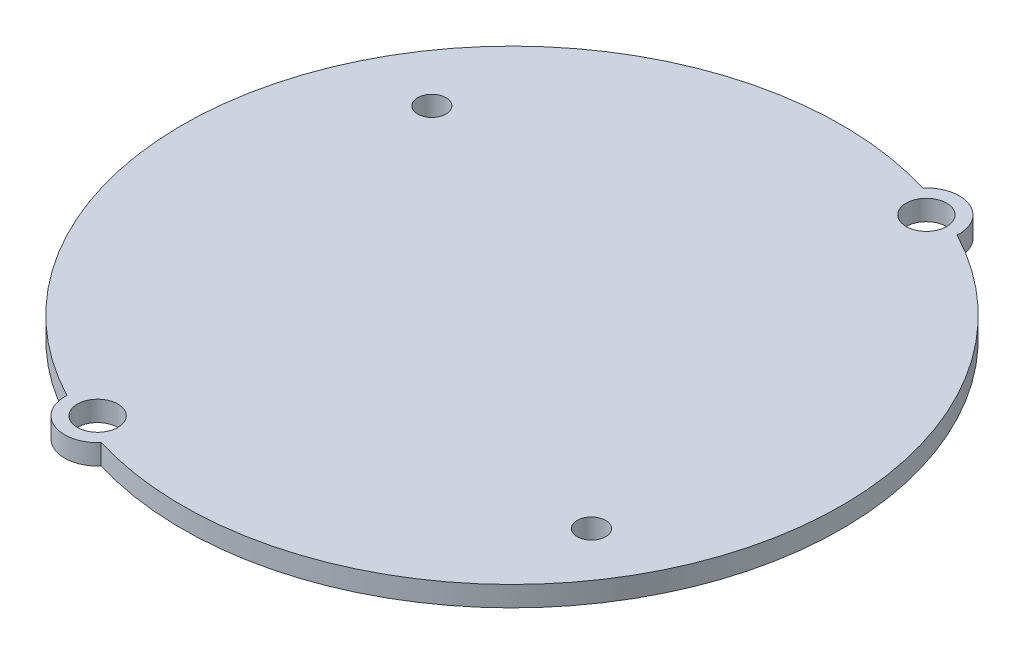
ISO-10303-21;
HEADER;
FILE_DESCRIPTION(('STEP AP214'),'2;1');
FILE_NAME('part.step','',(''),(''),'','','');
FILE_SCHEMA(('AUTOMOTIVE_DESIGN { 1 0 10303 214 1 1 1 1 }'));
ENDSEC;
DATA;
#1=APPLICATION_CONTEXT('core data for automotive mechanical design processes');
#2=APPLICATION_PROTOCOL_DEFINITION('international standard','automotive_design',2000,#1);
#3=PRODUCT_CONTEXT('',#1,'mechanical');
#4=PRODUCT('Part','Part','',(#3));
#5=PRODUCT_RELATED_PRODUCT_CATEGORY('part','',(#4));
#6=PRODUCT_DEFINITION_FORMATION('','',#4);
#7=PRODUCT_DEFINITION_CONTEXT('part definition',#1,'design');
#8=PRODUCT_DEFINITION('design','',#6,#7);
#9=PRODUCT_DEFINITION_SHAPE('','',#8);
#10=(LENGTH_UNIT() NAMED_UNIT(*) SI_UNIT(.MILLI.,.METRE.));
#11=(NAMED_UNIT(*) PLANE_ANGLE_UNIT() SI_UNIT($,.RADIAN.));
#12=(NAMED_UNIT(*) SI_UNIT($,.STERADIAN.) SOLID_ANGLE_UNIT());
#13=UNCERTAINTY_MEASURE_WITH_UNIT(LENGTH_MEASURE(1.E-05),#10,'distance_accuracy_value','');
#14=(GEOMETRIC_REPRESENTATION_CONTEXT(3) GLOBAL_UNCERTAINTY_ASSIGNED_CONTEXT((#13)) GLOBAL_UNIT_ASSIGNED_CONTEXT((#10,
#11,#12)) REPRESENTATION_CONTEXT('',''));
#15=CARTESIAN_POINT('',(0.,0.,0.));
#16=DIRECTION('',(0.,0.,1.));
#17=DIRECTION('',(1.,0.,0.));
#18=AXIS2_PLACEMENT_3D('',#15,#16,#17);
#19=CARTESIAN_POINT('',(5.92494005085191,2.,-14.5));
#20=DIRECTION('',(0.,1.,0.));
#21=DIRECTION('',(0.,0.,1.));
#22=AXIS2_PLACEMENT_3D('',#19,#20,#21);
#23=PLANE('',#22);
#24=CARTESIAN_POINT('',(-21.83,2.,-13.9266116253345));
#25=DIRECTION('',(0.,1.,0.));
#26=DIRECTION('',(0.,0.,1.));
#27=AXIS2_PLACEMENT_3D('',#24,#25,#26);
#28=CIRCLE('',#27,1.40000000000001);
#29=CARTESIAN_POINT('',(-21.83,2.,-12.5266116253345));
#30=VERTEX_POINT('',#29);
#31=EDGE_CURVE('E120',#30,#30,#28,.F.);
#32=ORIENTED_EDGE('',*,*,#31,.T.);
#33=EDGE_LOOP('',(#32));
#34=FACE_BOUND('',#33,.T.);
#35=CARTESIAN_POINT('',(22.12,2.,14.29));
#36=DIRECTION('',(0.,1.,0.));
#37=DIRECTION('',(0.,0.,1.));
#38=AXIS2_PLACEMENT_3D('',#35,#36,#37);
#39=CIRCLE('',#38,1.4);
#40=CARTESIAN_POINT('',(22.12,2.,15.69));
#41=VERTEX_POINT('',#40);
#42=EDGE_CURVE('E125',#41,#41,#39,.F.);
#43=ORIENTED_EDGE('',*,*,#42,.T.);
#44=EDGE_LOOP('',(#43));
#45=FACE_BOUND('',#44,.T.);
#46=CARTESIAN_POINT('',(11.8498801017038,2.,-29.));
#47=DIRECTION('',(0.,1.,0.));
#48=DIRECTION('',(0.,0.,1.));
#49=AXIS2_PLACEMENT_3D('',#46,#47,#48);
#50=CIRCLE('',#49,2.);
#51=CARTESIAN_POINT('',(11.8498801017038,2.,-27.));
#52=VERTEX_POINT('',#51);
#53=EDGE_CURVE('E99',#52,#52,#50,.T.);
#54=ORIENTED_EDGE('',*,*,#53,.F.);
#55=EDGE_LOOP('',(#54));
#56=FACE_BOUND('',#55,.T.);
#57=CARTESIAN_POINT('',(0.,2.,0.));
#58=DIRECTION('',(0.,1.,0.));
#59=DIRECTION('',(0.,0.,1.));
#60=AXIS2_PLACEMENT_3D('',#57,#58,#59);
#61=CIRCLE('',#60,32.5);
#62=CARTESIAN_POINT('',(-9.3831152355607,2.,31.1160271962246));
#63=VERTEX_POINT('',#62);
#64=CARTESIAN_POINT('',(15.0926292376997,2.,-28.7830252526264));
#65=VERTEX_POINT('',#64);
#66=EDGE_CURVE('E84',#63,#65,#61,.T.);
#67=ORIENTED_EDGE('',*,*,#66,.T.);
#68=CARTESIAN_POINT('',(11.8498801017038,2.,-29.));
#69=DIRECTION('',(0.,1.,0.));
#70=DIRECTION('',(0.,0.,1.));
#71=AXIS2_PLACEMENT_3D('',#68,#69,#70);
#72=CIRCLE('',#71,3.25);
#73=CARTESIAN_POINT('',(9.38311523556074,2.,-31.1160271962246));
#74=VERTEX_POINT('',#73);
#75=EDGE_CURVE('E79',#65,#74,#72,.T.);
#76=ORIENTED_EDGE('',*,*,#75,.T.);
#77=CARTESIAN_POINT('',(0.,2.,0.));
#78=DIRECTION('',(0.,1.,0.));
#79=DIRECTION('',(0.,0.,1.));
#80=AXIS2_PLACEMENT_3D('',#77,#78,#79);
#81=CIRCLE('',#80,32.5);
#82=CARTESIAN_POINT('',(-15.0926292376997,2.,28.7830252526264));
#83=VERTEX_POINT('',#82);
#84=EDGE_CURVE('E82',#74,#83,#81,.T.);
#85=ORIENTED_EDGE('',*,*,#84,.T.);
#86=CARTESIAN_POINT('',(-11.8498801017038,2.,29.));
#87=DIRECTION('',(0.,1.,0.));
#88=DIRECTION('',(0.,0.,1.));
#89=AXIS2_PLACEMENT_3D('',#86,#87,#88);
#90=CIRCLE('',#89,3.25000000000003);
#91=EDGE_CURVE('E49',#83,#63,#90,.T.);
#92=ORIENTED_EDGE('',*,*,#91,.T.);
#93=EDGE_LOOP('',(#67,#76,#85,#92));
#94=FACE_BOUND('',#93,.T.);
#95=CARTESIAN_POINT('',(-11.8498801017038,2.,29.));
#96=DIRECTION('',(0.,1.,0.));
#97=DIRECTION('',(0.,0.,1.));
#98=AXIS2_PLACEMENT_3D('',#95,#96,#97);
#99=CIRCLE('',#98,2.);
#100=CARTESIAN_POINT('',(-11.8498801017038,2.,31.));
#101=VERTEX_POINT('',#100);
#102=EDGE_CURVE('E114',#101,#101,#99,.T.);
#103=ORIENTED_EDGE('',*,*,#102,.F.);
#104=EDGE_LOOP('',(#103));
#105=FACE_BOUND('',#104,.T.);
#106=ADVANCED_FACE('F32',(#34,#45,#56,#94,#105),#23,.T.);
#107=CARTESIAN_POINT('',(5.92494005085191,0.,-14.5));
#108=DIRECTION('',(0.,1.,0.));
#109=DIRECTION('',(0.,0.,1.));
#110=AXIS2_PLACEMENT_3D('',#107,#108,#109);
#111=PLANE('',#110);
#112=CARTESIAN_POINT('',(-21.83,0.,-13.9266116253345));
#113=DIRECTION('',(0.,-1.,0.));
#114=DIRECTION('',(0.,0.,-1.));
#115=AXIS2_PLACEMENT_3D('',#112,#113,#114);
#116=CIRCLE('',#115,1.40000000000001);
#117=CARTESIAN_POINT('',(-21.83,0.,-15.3266116253345));
#118=VERTEX_POINT('',#117);
#119=EDGE_CURVE('E128',#118,#118,#116,.F.);
#120=ORIENTED_EDGE('',*,*,#119,.T.);
#121=EDGE_LOOP('',(#120));
#122=FACE_BOUND('',#121,.T.);
#123=CARTESIAN_POINT('',(22.12,0.,14.29));
#124=DIRECTION('',(0.,-1.,0.));
#125=DIRECTION('',(0.,0.,-1.));
#126=AXIS2_PLACEMENT_3D('',#123,#124,#125);
#127=CIRCLE('',#126,1.4);
#128=CARTESIAN_POINT('',(22.12,0.,12.89));
#129=VERTEX_POINT('',#128);
#130=EDGE_CURVE('E129',#129,#129,#127,.F.);
#131=ORIENTED_EDGE('',*,*,#130,.T.);
#132=EDGE_LOOP('',(#131));
#133=FACE_BOUND('',#132,.T.);
#134=CARTESIAN_POINT('',(0.,0.,0.));
#135=DIRECTION('',(0.,1.,0.));
#136=DIRECTION('',(0.,0.,1.));
#137=AXIS2_PLACEMENT_3D('',#134,#135,#136);
#138=CIRCLE('',#137,32.5);
#139=CARTESIAN_POINT('',(-9.3831152355607,0.,31.1160271962246));
#140=VERTEX_POINT('',#139);
#141=CARTESIAN_POINT('',(15.0926292376997,0.,-28.7830252526264));
#142=VERTEX_POINT('',#141);
#143=EDGE_CURVE('E96',#140,#142,#138,.T.);
#144=ORIENTED_EDGE('',*,*,#143,.F.);
#145=CARTESIAN_POINT('',(-11.8498801017038,0.,29.));
#146=DIRECTION('',(0.,1.,0.));
#147=DIRECTION('',(0.,0.,1.));
#148=AXIS2_PLACEMENT_3D('',#145,#146,#147);
#149=CIRCLE('',#148,3.25000000000003);
#150=CARTESIAN_POINT('',(-15.0926292376997,0.,28.7830252526264));
#151=VERTEX_POINT('',#150);
#152=EDGE_CURVE('E72',#151,#140,#149,.T.);
#153=ORIENTED_EDGE('',*,*,#152,.F.);
#154=CARTESIAN_POINT('',(0.,0.,0.));
#155=DIRECTION('',(0.,1.,0.));
#156=DIRECTION('',(0.,0.,1.));
#157=AXIS2_PLACEMENT_3D('',#154,#155,#156);
#158=CIRCLE('',#157,32.5);
#159=CARTESIAN_POINT('',(9.38311523556074,0.,-31.1160271962246));
#160=VERTEX_POINT('',#159);
#161=EDGE_CURVE('E66',#160,#151,#158,.T.);
#162=ORIENTED_EDGE('',*,*,#161,.F.);
#163=CARTESIAN_POINT('',(11.8498801017038,0.,-29.));
#164=DIRECTION('',(0.,1.,0.));
#165=DIRECTION('',(0.,0.,1.));
#166=AXIS2_PLACEMENT_3D('',#163,#164,#165);
#167=CIRCLE('',#166,3.25);
#168=EDGE_CURVE('E88',#142,#160,#167,.T.);
#169=ORIENTED_EDGE('',*,*,#168,.F.);
#170=EDGE_LOOP('',(#144,#153,#162,#169));
#171=FACE_BOUND('',#170,.T.);
#172=CARTESIAN_POINT('',(11.8498801017038,0.,-29.));
#173=DIRECTION('',(0.,1.,0.));
#174=DIRECTION('',(0.,0.,1.));
#175=AXIS2_PLACEMENT_3D('',#172,#173,#174);
#176=CIRCLE('',#175,2.);
#177=CARTESIAN_POINT('',(11.8498801017038,0.,-27.));
#178=VERTEX_POINT('',#177);
#179=EDGE_CURVE('E111',#178,#178,#176,.T.);
#180=ORIENTED_EDGE('',*,*,#179,.T.);
#181=EDGE_LOOP('',(#180));
#182=FACE_BOUND('',#181,.T.);
#183=CARTESIAN_POINT('',(-11.8498801017038,0.,29.));
#184=DIRECTION('',(0.,1.,0.));
#185=DIRECTION('',(0.,0.,1.));
#186=AXIS2_PLACEMENT_3D('',#183,#184,#185);
#187=CIRCLE('',#186,2.);
#188=CARTESIAN_POINT('',(-11.8498801017038,0.,31.));
#189=VERTEX_POINT('',#188);
#190=EDGE_CURVE('E117',#189,#189,#187,.T.);
#191=ORIENTED_EDGE('',*,*,#190,.T.);
#192=EDGE_LOOP('',(#191));
#193=FACE_BOUND('',#192,.T.);
#194=ADVANCED_FACE('F107',(#122,#133,#171,#182,#193),#111,.F.);
#195=CARTESIAN_POINT('',(0.,2.,0.));
#196=DIRECTION('',(0.,-1.,0.));
#197=DIRECTION('',(0.,0.,-1.));
#198=AXIS2_PLACEMENT_3D('',#195,#196,#197);
#199=CYLINDRICAL_SURFACE('',#198,32.5);
#200=ORIENTED_EDGE('',*,*,#143,.T.);
#201=DIRECTION('',(0.,-1.,0.));
#202=VECTOR('',#201,1.);
#203=CARTESIAN_POINT('',(15.0926292376997,2.,-28.7830252526264));
#204=LINE('',#203,#202);
#205=EDGE_CURVE('E11',#65,#142,#204,.T.);
#206=ORIENTED_EDGE('',*,*,#205,.F.);
#207=ORIENTED_EDGE('',*,*,#66,.F.);
#208=DIRECTION('',(0.,-1.,0.));
#209=VECTOR('',#208,1.);
#210=CARTESIAN_POINT('',(-9.3831152355607,2.,31.1160271962246));
#211=LINE('',#210,#209);
#212=EDGE_CURVE('E92',#63,#140,#211,.T.);
#213=ORIENTED_EDGE('',*,*,#212,.T.);
#214=EDGE_LOOP('',(#200,#206,#207,#213));
#215=FACE_BOUND('',#214,.T.);
#216=ADVANCED_FACE('F34',(#215),#199,.T.);
#217=CARTESIAN_POINT('',(11.8498801017038,2.,-29.));
#218=DIRECTION('',(0.,-1.,0.));
#219=DIRECTION('',(0.,0.,-1.));
#220=AXIS2_PLACEMENT_3D('',#217,#218,#219);
#221=CYLINDRICAL_SURFACE('',#220,3.25);
#222=ORIENTED_EDGE('',*,*,#168,.T.);
#223=DIRECTION('',(0.,-1.,0.));
#224=VECTOR('',#223,1.);
#225=CARTESIAN_POINT('',(9.38311523556074,2.,-31.1160271962246));
#226=LINE('',#225,#224);
#227=EDGE_CURVE('E41',#74,#160,#226,.T.);
#228=ORIENTED_EDGE('',*,*,#227,.F.);
#229=ORIENTED_EDGE('',*,*,#75,.F.);
#230=ORIENTED_EDGE('',*,*,#205,.T.);
#231=EDGE_LOOP('',(#222,#228,#229,#230));
#232=FACE_BOUND('',#231,.T.);
#233=ADVANCED_FACE('F87',(#232),#221,.T.);
#234=CARTESIAN_POINT('',(0.,2.,0.));
#235=DIRECTION('',(0.,-1.,0.));
#236=DIRECTION('',(0.,0.,-1.));
#237=AXIS2_PLACEMENT_3D('',#234,#235,#236);
#238=CYLINDRICAL_SURFACE('',#237,32.5);
#239=ORIENTED_EDGE('',*,*,#161,.T.);
#240=DIRECTION('',(0.,-1.,0.));
#241=VECTOR('',#240,1.);
#242=CARTESIAN_POINT('',(-15.0926292376997,2.,28.7830252526264));
#243=LINE('',#242,#241);
#244=EDGE_CURVE('E89',#83,#151,#243,.T.);
#245=ORIENTED_EDGE('',*,*,#244,.F.);
#246=ORIENTED_EDGE('',*,*,#84,.F.);
#247=ORIENTED_EDGE('',*,*,#227,.T.);
#248=EDGE_LOOP('',(#239,#245,#246,#247));
#249=FACE_BOUND('',#248,.T.);
#250=ADVANCED_FACE('F90',(#249),#238,.T.);
#251=CARTESIAN_POINT('',(-11.8498801017038,2.,29.));
#252=DIRECTION('',(0.,-1.,0.));
#253=DIRECTION('',(0.,0.,-1.));
#254=AXIS2_PLACEMENT_3D('',#251,#252,#253);
#255=CYLINDRICAL_SURFACE('',#254,3.25000000000003);
#256=ORIENTED_EDGE('',*,*,#152,.T.);
#257=ORIENTED_EDGE('',*,*,#212,.F.);
#258=ORIENTED_EDGE('',*,*,#91,.F.);
#259=ORIENTED_EDGE('',*,*,#244,.T.);
#260=EDGE_LOOP('',(#256,#257,#258,#259));
#261=FACE_BOUND('',#260,.T.);
#262=ADVANCED_FACE('F104',(#261),#255,.T.);
#263=CARTESIAN_POINT('',(11.8498801017038,2.,-29.));
#264=DIRECTION('',(0.,-1.,0.));
#265=DIRECTION('',(0.,0.,-1.));
#266=AXIS2_PLACEMENT_3D('',#263,#264,#265);
#267=CYLINDRICAL_SURFACE('',#266,2.);
#268=ORIENTED_EDGE('',*,*,#53,.T.);
#269=EDGE_LOOP('',(#268));
#270=FACE_BOUND('',#269,.T.);
#271=ORIENTED_EDGE('',*,*,#179,.F.);
#272=EDGE_LOOP('',(#271));
#273=FACE_BOUND('',#272,.T.);
#274=ADVANCED_FACE('F158',(#270,#273),#267,.F.);
#275=CARTESIAN_POINT('',(-11.8498801017038,2.,29.));
#276=DIRECTION('',(0.,-1.,0.));
#277=DIRECTION('',(0.,0.,-1.));
#278=AXIS2_PLACEMENT_3D('',#275,#276,#277);
#279=CYLINDRICAL_SURFACE('',#278,2.);
#280=ORIENTED_EDGE('',*,*,#102,.T.);
#281=EDGE_LOOP('',(#280));
#282=FACE_BOUND('',#281,.T.);
#283=ORIENTED_EDGE('',*,*,#190,.F.);
#284=EDGE_LOOP('',(#283));
#285=FACE_BOUND('',#284,.T.);
#286=ADVANCED_FACE('F145',(#282,#285),#279,.F.);
#287=CARTESIAN_POINT('',(22.12,10.,14.29));
#288=DIRECTION('',(0.,-1.,0.));
#289=DIRECTION('',(0.,0.,-1.));
#290=AXIS2_PLACEMENT_3D('',#287,#288,#289);
#291=CYLINDRICAL_SURFACE('',#290,1.4);
#292=ORIENTED_EDGE('',*,*,#42,.F.);
#293=EDGE_LOOP('',(#292));
#294=FACE_BOUND('',#293,.T.);
#295=ORIENTED_EDGE('',*,*,#130,.F.);
#296=EDGE_LOOP('',(#295));
#297=FACE_BOUND('',#296,.T.);
#298=ADVANCED_FACE('F139',(#294,#297),#291,.F.);
#299=CARTESIAN_POINT('',(-21.83,10.,-13.9266116253345));
#300=DIRECTION('',(0.,-1.,0.));
#301=DIRECTION('',(0.,0.,-1.));
#302=AXIS2_PLACEMENT_3D('',#299,#300,#301);
#303=CYLINDRICAL_SURFACE('',#302,1.40000000000001);
#304=ORIENTED_EDGE('',*,*,#31,.F.);
#305=EDGE_LOOP('',(#304));
#306=FACE_BOUND('',#305,.T.);
#307=ORIENTED_EDGE('',*,*,#119,.F.);
#308=EDGE_LOOP('',(#307));
#309=FACE_BOUND('',#308,.T.);
#310=ADVANCED_FACE('F137',(#306,#309),#303,.F.);
#311=CLOSED_SHELL('',(#106,#194,#216,#233,#250,#262,#274,#286,#298,#310));
#312=MANIFOLD_SOLID_BREP('B2',#311);
#313=ADVANCED_BREP_SHAPE_REPRESENTATION('',(#18,#312),#14);
#314=SHAPE_DEFINITION_REPRESENTATION(#9,#313);
ENDSEC;
END-ISO-10303-21;
